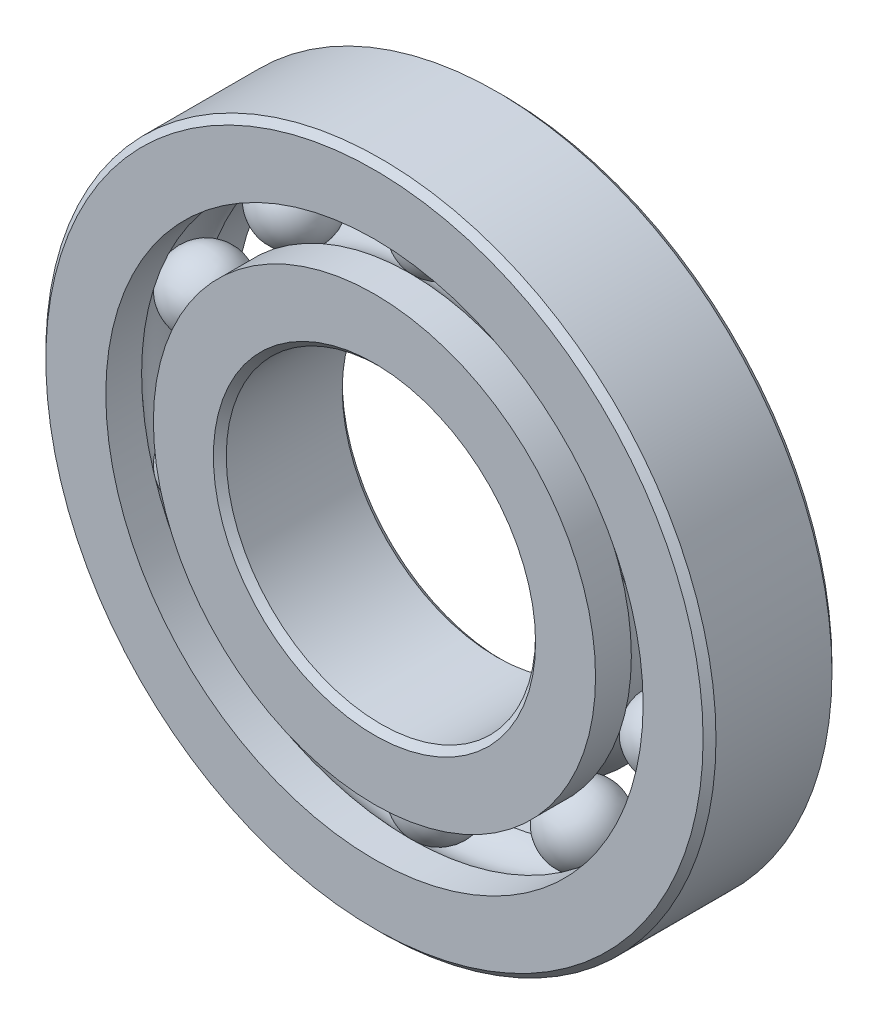
ISO-10303-21;
HEADER;
FILE_DESCRIPTION(('STEP AP214'),'2;1');
FILE_NAME('part.step','',(''),(''),'','','');
FILE_SCHEMA(('AUTOMOTIVE_DESIGN { 1 0 10303 214 1 1 1 1 }'));
ENDSEC;
DATA;
#1=APPLICATION_CONTEXT('core data for automotive mechanical design processes');
#2=APPLICATION_PROTOCOL_DEFINITION('international standard','automotive_design',2000,#1);
#3=PRODUCT_CONTEXT('',#1,'mechanical');
#4=PRODUCT('Part','Part','',(#3));
#5=PRODUCT_RELATED_PRODUCT_CATEGORY('part','',(#4));
#6=PRODUCT_DEFINITION_FORMATION('','',#4);
#7=PRODUCT_DEFINITION_CONTEXT('part definition',#1,'design');
#8=PRODUCT_DEFINITION('design','',#6,#7);
#9=PRODUCT_DEFINITION_SHAPE('','',#8);
#10=(LENGTH_UNIT() NAMED_UNIT(*) SI_UNIT(.MILLI.,.METRE.));
#11=(NAMED_UNIT(*) PLANE_ANGLE_UNIT() SI_UNIT($,.RADIAN.));
#12=(NAMED_UNIT(*) SI_UNIT($,.STERADIAN.) SOLID_ANGLE_UNIT());
#13=UNCERTAINTY_MEASURE_WITH_UNIT(LENGTH_MEASURE(1.E-05),#10,'distance_accuracy_value','');
#14=(GEOMETRIC_REPRESENTATION_CONTEXT(3) GLOBAL_UNCERTAINTY_ASSIGNED_CONTEXT((#13)) GLOBAL_UNIT_ASSIGNED_CONTEXT((#10,
#11,#12)) REPRESENTATION_CONTEXT('',''));
#15=CARTESIAN_POINT('',(0.,0.,0.));
#16=DIRECTION('',(0.,0.,1.));
#17=DIRECTION('',(1.,0.,0.));
#18=AXIS2_PLACEMENT_3D('',#15,#16,#17);
#19=CARTESIAN_POINT('',(-8.8645363361357,12.2009875464173,0.));
#20=DIRECTION('',(0.,0.,1.));
#21=DIRECTION('',(-0.587785252292462,0.809016994374955,0.));
#22=AXIS2_PLACEMENT_3D('',#19,#20,#21);
#23=SPHERICAL_SURFACE('',#22,2.29317598176668);
#24=CARTESIAN_POINT('',(-8.8645363361357,12.2009875464173,2.29317598176668));
#25=VERTEX_POINT('',#24);
#26=VERTEX_LOOP('',#25);
#27=FACE_BOUND('',#26,.T.);
#28=ADVANCED_FACE('F43',(#27),#23,.T.);
#29=CLOSED_SHELL('',(#28));
#30=MANIFOLD_SOLID_BREP('B2',#29);
#31=CARTESIAN_POINT('',(-14.3431210863762,4.66036254641734,0.));
#32=DIRECTION('',(0.,0.,1.));
#33=DIRECTION('',(-0.95105651629515,0.309016994374958,0.));
#34=AXIS2_PLACEMENT_3D('',#31,#32,#33);
#35=SPHERICAL_SURFACE('',#34,2.29317598176668);
#36=CARTESIAN_POINT('',(-14.3431210863762,4.66036254641734,2.29317598176668));
#37=VERTEX_POINT('',#36);
#38=VERTEX_LOOP('',#37);
#39=FACE_BOUND('',#38,.T.);
#40=ADVANCED_FACE('F63',(#39),#35,.T.);
#41=CLOSED_SHELL('',(#40));
#42=MANIFOLD_SOLID_BREP('B6',#41);
#43=CARTESIAN_POINT('',(-14.3431210863763,-4.66036254641704,0.));
#44=DIRECTION('',(0.,0.,1.));
#45=DIRECTION('',(-0.951056516295157,-0.309016994374938,0.));
#46=AXIS2_PLACEMENT_3D('',#43,#44,#45);
#47=SPHERICAL_SURFACE('',#46,2.29317598176668);
#48=CARTESIAN_POINT('',(-14.3431210863763,-4.66036254641704,2.29317598176668));
#49=VERTEX_POINT('',#48);
#50=VERTEX_LOOP('',#49);
#51=FACE_BOUND('',#50,.T.);
#52=ADVANCED_FACE('F83',(#51),#47,.T.);
#53=CLOSED_SHELL('',(#52));
#54=MANIFOLD_SOLID_BREP('B39',#53);
#55=CARTESIAN_POINT('',(-8.86453633613597,-12.2009875464171,0.));
#56=DIRECTION('',(0.,0.,1.));
#57=DIRECTION('',(-0.58778525229248,-0.809016994374942,0.));
#58=AXIS2_PLACEMENT_3D('',#55,#56,#57);
#59=SPHERICAL_SURFACE('',#58,2.29317598176668);
#60=CARTESIAN_POINT('',(-8.86453633613597,-12.2009875464171,2.29317598176668));
#61=VERTEX_POINT('',#60);
#62=VERTEX_LOOP('',#61);
#63=FACE_BOUND('',#62,.T.);
#64=ADVANCED_FACE('F103',(#63),#59,.T.);
#65=CLOSED_SHELL('',(#64));
#66=MANIFOLD_SOLID_BREP('B59',#65);
#67=CARTESIAN_POINT('',(-1.05311866879462E-13,-15.08125,0.));
#68=DIRECTION('',(0.,0.,1.));
#69=DIRECTION('',(0.,-1.,0.));
#70=AXIS2_PLACEMENT_3D('',#67,#68,#69);
#71=SPHERICAL_SURFACE('',#70,2.29317598176668);
#72=CARTESIAN_POINT('',(-1.05311866879462E-13,-15.08125,2.29317598176668));
#73=VERTEX_POINT('',#72);
#74=VERTEX_LOOP('',#73);
#75=FACE_BOUND('',#74,.T.);
#76=ADVANCED_FACE('F123',(#75),#71,.T.);
#77=CLOSED_SHELL('',(#76));
#78=MANIFOLD_SOLID_BREP('B79',#77);
#79=CARTESIAN_POINT('',(8.86453633613579,-12.2009875464172,0.));
#80=DIRECTION('',(0.,0.,1.));
#81=DIRECTION('',(0.587785252292469,-0.809016994374951,0.));
#82=AXIS2_PLACEMENT_3D('',#79,#80,#81);
#83=SPHERICAL_SURFACE('',#82,2.29317598176668);
#84=CARTESIAN_POINT('',(8.86453633613579,-12.2009875464172,2.29317598176668));
#85=VERTEX_POINT('',#84);
#86=VERTEX_LOOP('',#85);
#87=FACE_BOUND('',#86,.T.);
#88=ADVANCED_FACE('F143',(#87),#83,.T.);
#89=CLOSED_SHELL('',(#88));
#90=MANIFOLD_SOLID_BREP('B99',#89);
#91=CARTESIAN_POINT('',(14.3431210863763,-4.66036254641724,0.));
#92=DIRECTION('',(0.,0.,1.));
#93=DIRECTION('',(0.951056516295152,-0.309016994374952,0.));
#94=AXIS2_PLACEMENT_3D('',#91,#92,#93);
#95=SPHERICAL_SURFACE('',#94,2.29317598176668);
#96=CARTESIAN_POINT('',(14.3431210863763,-4.66036254641724,2.29317598176668));
#97=VERTEX_POINT('',#96);
#98=VERTEX_LOOP('',#97);
#99=FACE_BOUND('',#98,.T.);
#100=ADVANCED_FACE('F163',(#99),#95,.T.);
#101=CLOSED_SHELL('',(#100));
#102=MANIFOLD_SOLID_BREP('B119',#101);
#103=CARTESIAN_POINT('',(14.3431210863763,4.66036254641714,0.));
#104=DIRECTION('',(0.,0.,1.));
#105=DIRECTION('',(0.951056516295155,0.309016994374945,0.));
#106=AXIS2_PLACEMENT_3D('',#103,#104,#105);
#107=SPHERICAL_SURFACE('',#106,2.29317598176668);
#108=CARTESIAN_POINT('',(14.3431210863763,4.66036254641714,2.29317598176668));
#109=VERTEX_POINT('',#108);
#110=VERTEX_LOOP('',#109);
#111=FACE_BOUND('',#110,.T.);
#112=ADVANCED_FACE('F183',(#111),#107,.T.);
#113=CLOSED_SHELL('',(#112));
#114=MANIFOLD_SOLID_BREP('B139',#113);
#115=CARTESIAN_POINT('',(8.86453633613588,12.2009875464172,0.));
#116=DIRECTION('',(0.,0.,1.));
#117=DIRECTION('',(0.587785252292474,0.809016994374947,0.));
#118=AXIS2_PLACEMENT_3D('',#115,#116,#117);
#119=SPHERICAL_SURFACE('',#118,2.29317598176668);
#120=CARTESIAN_POINT('',(8.86453633613588,12.2009875464172,2.29317598176668));
#121=VERTEX_POINT('',#120);
#122=VERTEX_LOOP('',#121);
#123=FACE_BOUND('',#122,.T.);
#124=ADVANCED_FACE('F203',(#123),#119,.T.);
#125=CLOSED_SHELL('',(#124));
#126=MANIFOLD_SOLID_BREP('B159',#125);
#127=CARTESIAN_POINT('',(0.,15.08125,0.));
#128=DIRECTION('',(0.,0.,1.));
#129=DIRECTION('',(0.,1.,0.));
#130=AXIS2_PLACEMENT_3D('',#127,#128,#129);
#131=SPHERICAL_SURFACE('',#130,2.29317598176668);
#132=CARTESIAN_POINT('',(0.,15.08125,2.29317598176668));
#133=VERTEX_POINT('',#132);
#134=VERTEX_LOOP('',#133);
#135=FACE_BOUND('',#134,.T.);
#136=ADVANCED_FACE('F225',(#135),#131,.T.);
#137=CLOSED_SHELL('',(#136));
#138=MANIFOLD_SOLID_BREP('B179',#137);
#139=CARTESIAN_POINT('',(0.,13.6158653846154,3.96875));
#140=DIRECTION('',(0.,0.,-1.));
#141=DIRECTION('',(-1.,0.,0.));
#142=AXIS2_PLACEMENT_3D('',#139,#140,#141);
#143=PLANE('',#142);
#144=CARTESIAN_POINT('',(0.,0.,3.96875));
#145=DIRECTION('',(0.,0.,1.));
#146=DIRECTION('',(1.,0.,0.));
#147=AXIS2_PLACEMENT_3D('',#144,#145,#146);
#148=CIRCLE('',#147,9.921875);
#149=CARTESIAN_POINT('',(9.921875,0.,3.96875));
#150=VERTEX_POINT('',#149);
#151=EDGE_CURVE('E272',#150,#150,#148,.T.);
#152=ORIENTED_EDGE('',*,*,#151,.F.);
#153=EDGE_LOOP('',(#152));
#154=FACE_BOUND('',#153,.T.);
#155=CARTESIAN_POINT('',(0.,0.,3.96875));
#156=DIRECTION('',(0.,0.,1.));
#157=DIRECTION('',(1.,0.,0.));
#158=AXIS2_PLACEMENT_3D('',#155,#156,#157);
#159=CIRCLE('',#158,13.6158653846154);
#160=CARTESIAN_POINT('',(13.6158653846154,0.,3.96875));
#161=VERTEX_POINT('',#160);
#162=EDGE_CURVE('E224',#161,#161,#159,.T.);
#163=ORIENTED_EDGE('',*,*,#162,.T.);
#164=EDGE_LOOP('',(#163));
#165=FACE_BOUND('',#164,.T.);
#166=ADVANCED_FACE('F244',(#154,#165),#143,.F.);
#167=CARTESIAN_POINT('',(0.,0.,3.96875));
#168=DIRECTION('',(0.,0.,1.));
#169=DIRECTION('',(1.,0.,0.));
#170=AXIS2_PLACEMENT_3D('',#167,#168,#169);
#171=CYLINDRICAL_SURFACE('',#170,13.6158653846154);
#172=ORIENTED_EDGE('',*,*,#162,.F.);
#173=EDGE_LOOP('',(#172));
#174=FACE_BOUND('',#173,.T.);
#175=CARTESIAN_POINT('',(0.,0.,1.76388888888889));
#176=DIRECTION('',(0.,0.,1.));
#177=DIRECTION('',(1.,0.,0.));
#178=AXIS2_PLACEMENT_3D('',#175,#176,#177);
#179=CIRCLE('',#178,13.6158653846154);
#180=CARTESIAN_POINT('',(13.6158653846154,0.,1.76388888888889));
#181=VERTEX_POINT('',#180);
#182=EDGE_CURVE('E250',#181,#181,#179,.T.);
#183=ORIENTED_EDGE('',*,*,#182,.T.);
#184=EDGE_LOOP('',(#183));
#185=FACE_BOUND('',#184,.T.);
#186=ADVANCED_FACE('F279',(#174,#185),#171,.T.);
#187=CARTESIAN_POINT('',(0.,0.,0.));
#188=DIRECTION('',(0.,0.,1.));
#189=DIRECTION('',(1.,0.,0.));
#190=AXIS2_PLACEMENT_3D('',#187,#188,#189);
#191=TOROIDAL_SURFACE('',#190,15.08125,2.29317598176668);
#192=ORIENTED_EDGE('',*,*,#182,.F.);
#193=EDGE_LOOP('',(#192));
#194=FACE_BOUND('',#193,.T.);
#195=CARTESIAN_POINT('',(0.,0.,-1.76388888888889));
#196=DIRECTION('',(0.,0.,1.));
#197=DIRECTION('',(1.,0.,0.));
#198=AXIS2_PLACEMENT_3D('',#195,#196,#197);
#199=CIRCLE('',#198,13.6158653846154);
#200=CARTESIAN_POINT('',(13.6158653846154,0.,-1.76388888888889));
#201=VERTEX_POINT('',#200);
#202=EDGE_CURVE('E254',#201,#201,#199,.T.);
#203=ORIENTED_EDGE('',*,*,#202,.T.);
#204=EDGE_LOOP('',(#203));
#205=FACE_BOUND('',#204,.T.);
#206=ADVANCED_FACE('F283',(#194,#205),#191,.F.);
#207=CARTESIAN_POINT('',(0.,0.,3.96875));
#208=DIRECTION('',(0.,0.,1.));
#209=DIRECTION('',(1.,0.,0.));
#210=AXIS2_PLACEMENT_3D('',#207,#208,#209);
#211=CYLINDRICAL_SURFACE('',#210,13.6158653846154);
#212=ORIENTED_EDGE('',*,*,#202,.F.);
#213=EDGE_LOOP('',(#212));
#214=FACE_BOUND('',#213,.T.);
#215=CARTESIAN_POINT('',(0.,0.,-3.96875));
#216=DIRECTION('',(0.,0.,1.));
#217=DIRECTION('',(1.,0.,0.));
#218=AXIS2_PLACEMENT_3D('',#215,#216,#217);
#219=CIRCLE('',#218,13.6158653846154);
#220=CARTESIAN_POINT('',(13.6158653846154,0.,-3.96875));
#221=VERTEX_POINT('',#220);
#222=EDGE_CURVE('E258',#221,#221,#219,.T.);
#223=ORIENTED_EDGE('',*,*,#222,.T.);
#224=EDGE_LOOP('',(#223));
#225=FACE_BOUND('',#224,.T.);
#226=ADVANCED_FACE('F288',(#214,#225),#211,.T.);
#227=CARTESIAN_POINT('',(0.,9.921875,-3.96875));
#228=DIRECTION('',(0.,0.,1.));
#229=DIRECTION('',(1.,0.,0.));
#230=AXIS2_PLACEMENT_3D('',#227,#228,#229);
#231=PLANE('',#230);
#232=ORIENTED_EDGE('',*,*,#222,.F.);
#233=EDGE_LOOP('',(#232));
#234=FACE_BOUND('',#233,.T.);
#235=CARTESIAN_POINT('',(0.,0.,-3.96875));
#236=DIRECTION('',(0.,0.,1.));
#237=DIRECTION('',(1.,0.,0.));
#238=AXIS2_PLACEMENT_3D('',#235,#236,#237);
#239=CIRCLE('',#238,9.921875);
#240=CARTESIAN_POINT('',(9.921875,0.,-3.96875));
#241=VERTEX_POINT('',#240);
#242=EDGE_CURVE('E263',#241,#241,#239,.T.);
#243=ORIENTED_EDGE('',*,*,#242,.T.);
#244=EDGE_LOOP('',(#243));
#245=FACE_BOUND('',#244,.T.);
#246=ADVANCED_FACE('F294',(#234,#245),#231,.F.);
#247=CARTESIAN_POINT('',(0.,0.,-3.571875));
#248=DIRECTION('',(0.,0.,-1.));
#249=DIRECTION('',(-1.,0.,0.));
#250=AXIS2_PLACEMENT_3D('',#247,#248,#249);
#251=CONICAL_SURFACE('',#250,9.525,0.785398163397446);
#252=ORIENTED_EDGE('',*,*,#242,.F.);
#253=EDGE_LOOP('',(#252));
#254=FACE_BOUND('',#253,.T.);
#255=CARTESIAN_POINT('',(0.,0.,-3.571875));
#256=DIRECTION('',(0.,0.,1.));
#257=DIRECTION('',(1.,0.,0.));
#258=AXIS2_PLACEMENT_3D('',#255,#256,#257);
#259=CIRCLE('',#258,9.525);
#260=CARTESIAN_POINT('',(9.525,0.,-3.571875));
#261=VERTEX_POINT('',#260);
#262=EDGE_CURVE('E266',#261,#261,#259,.T.);
#263=ORIENTED_EDGE('',*,*,#262,.T.);
#264=EDGE_LOOP('',(#263));
#265=FACE_BOUND('',#264,.T.);
#266=ADVANCED_FACE('F298',(#254,#265),#251,.F.);
#267=CARTESIAN_POINT('',(0.,0.,3.96875));
#268=DIRECTION('',(0.,0.,1.));
#269=DIRECTION('',(1.,0.,0.));
#270=AXIS2_PLACEMENT_3D('',#267,#268,#269);
#271=CYLINDRICAL_SURFACE('',#270,9.525);
#272=ORIENTED_EDGE('',*,*,#262,.F.);
#273=EDGE_LOOP('',(#272));
#274=FACE_BOUND('',#273,.T.);
#275=CARTESIAN_POINT('',(0.,0.,3.571875));
#276=DIRECTION('',(0.,0.,1.));
#277=DIRECTION('',(1.,0.,0.));
#278=AXIS2_PLACEMENT_3D('',#275,#276,#277);
#279=CIRCLE('',#278,9.525);
#280=CARTESIAN_POINT('',(9.525,0.,3.571875));
#281=VERTEX_POINT('',#280);
#282=EDGE_CURVE('E269',#281,#281,#279,.T.);
#283=ORIENTED_EDGE('',*,*,#282,.T.);
#284=EDGE_LOOP('',(#283));
#285=FACE_BOUND('',#284,.T.);
#286=ADVANCED_FACE('F302',(#274,#285),#271,.F.);
#287=CARTESIAN_POINT('',(0.,0.,3.96875));
#288=DIRECTION('',(0.,0.,1.));
#289=DIRECTION('',(1.,0.,0.));
#290=AXIS2_PLACEMENT_3D('',#287,#288,#289);
#291=CONICAL_SURFACE('',#290,9.921875,0.78539816339745);
#292=ORIENTED_EDGE('',*,*,#282,.F.);
#293=EDGE_LOOP('',(#292));
#294=FACE_BOUND('',#293,.T.);
#295=ORIENTED_EDGE('',*,*,#151,.T.);
#296=EDGE_LOOP('',(#295));
#297=FACE_BOUND('',#296,.T.);
#298=ADVANCED_FACE('F276',(#294,#297),#291,.F.);
#299=CLOSED_SHELL('',(#166,#186,#206,#226,#246,#266,#286,#298));
#300=MANIFOLD_SOLID_BREP('B199',#299);
#301=CARTESIAN_POINT('',(0.,0.,3.571875));
#302=DIRECTION('',(0.,0.,-1.));
#303=DIRECTION('',(-1.,0.,0.));
#304=AXIS2_PLACEMENT_3D('',#301,#302,#303);
#305=CONICAL_SURFACE('',#304,20.6375,0.785398163397448);
#306=CARTESIAN_POINT('',(0.,0.,3.96875));
#307=DIRECTION('',(0.,0.,1.));
#308=DIRECTION('',(1.,0.,0.));
#309=AXIS2_PLACEMENT_3D('',#306,#307,#308);
#310=CIRCLE('',#309,20.240625);
#311=CARTESIAN_POINT('',(20.240625,0.,3.96875));
#312=VERTEX_POINT('',#311);
#313=EDGE_CURVE('E393',#312,#312,#310,.T.);
#314=ORIENTED_EDGE('',*,*,#313,.F.);
#315=EDGE_LOOP('',(#314));
#316=FACE_BOUND('',#315,.T.);
#317=CARTESIAN_POINT('',(0.,0.,3.571875));
#318=DIRECTION('',(0.,0.,1.));
#319=DIRECTION('',(1.,0.,0.));
#320=AXIS2_PLACEMENT_3D('',#317,#318,#319);
#321=CIRCLE('',#320,20.6375);
#322=CARTESIAN_POINT('',(20.6375,0.,3.571875));
#323=VERTEX_POINT('',#322);
#324=EDGE_CURVE('E243',#323,#323,#321,.T.);
#325=ORIENTED_EDGE('',*,*,#324,.T.);
#326=EDGE_LOOP('',(#325));
#327=FACE_BOUND('',#326,.T.);
#328=ADVANCED_FACE('F365',(#316,#327),#305,.T.);
#329=CARTESIAN_POINT('',(0.,0.,3.96875));
#330=DIRECTION('',(0.,0.,1.));
#331=DIRECTION('',(1.,0.,0.));
#332=AXIS2_PLACEMENT_3D('',#329,#330,#331);
#333=CYLINDRICAL_SURFACE('',#332,20.6375);
#334=ORIENTED_EDGE('',*,*,#324,.F.);
#335=EDGE_LOOP('',(#334));
#336=FACE_BOUND('',#335,.T.);
#337=CARTESIAN_POINT('',(0.,0.,-3.571875));
#338=DIRECTION('',(0.,0.,1.));
#339=DIRECTION('',(1.,0.,0.));
#340=AXIS2_PLACEMENT_3D('',#337,#338,#339);
#341=CIRCLE('',#340,20.6375);
#342=CARTESIAN_POINT('',(20.6375,0.,-3.571875));
#343=VERTEX_POINT('',#342);
#344=EDGE_CURVE('E371',#343,#343,#341,.T.);
#345=ORIENTED_EDGE('',*,*,#344,.T.);
#346=EDGE_LOOP('',(#345));
#347=FACE_BOUND('',#346,.T.);
#348=ADVANCED_FACE('F400',(#336,#347),#333,.T.);
#349=CARTESIAN_POINT('',(0.,0.,-3.96875));
#350=DIRECTION('',(0.,0.,1.));
#351=DIRECTION('',(1.,0.,0.));
#352=AXIS2_PLACEMENT_3D('',#349,#350,#351);
#353=CONICAL_SURFACE('',#352,20.240625,0.785398163397446);
#354=ORIENTED_EDGE('',*,*,#344,.F.);
#355=EDGE_LOOP('',(#354));
#356=FACE_BOUND('',#355,.T.);
#357=CARTESIAN_POINT('',(0.,0.,-3.96875));
#358=DIRECTION('',(0.,0.,1.));
#359=DIRECTION('',(1.,0.,0.));
#360=AXIS2_PLACEMENT_3D('',#357,#358,#359);
#361=CIRCLE('',#360,20.240625);
#362=CARTESIAN_POINT('',(20.240625,0.,-3.96875));
#363=VERTEX_POINT('',#362);
#364=EDGE_CURVE('E375',#363,#363,#361,.T.);
#365=ORIENTED_EDGE('',*,*,#364,.T.);
#366=EDGE_LOOP('',(#365));
#367=FACE_BOUND('',#366,.T.);
#368=ADVANCED_FACE('F404',(#356,#367),#353,.T.);
#369=CARTESIAN_POINT('',(0.,20.240625,-3.96875));
#370=DIRECTION('',(0.,0.,1.));
#371=DIRECTION('',(1.,0.,0.));
#372=AXIS2_PLACEMENT_3D('',#369,#370,#371);
#373=PLANE('',#372);
#374=ORIENTED_EDGE('',*,*,#364,.F.);
#375=EDGE_LOOP('',(#374));
#376=FACE_BOUND('',#375,.T.);
#377=CARTESIAN_POINT('',(0.,0.,-3.96875));
#378=DIRECTION('',(0.,0.,1.));
#379=DIRECTION('',(1.,0.,0.));
#380=AXIS2_PLACEMENT_3D('',#377,#378,#379);
#381=CIRCLE('',#380,16.5466346153846);
#382=CARTESIAN_POINT('',(16.5466346153846,0.,-3.96875));
#383=VERTEX_POINT('',#382);
#384=EDGE_CURVE('E379',#383,#383,#381,.T.);
#385=ORIENTED_EDGE('',*,*,#384,.T.);
#386=EDGE_LOOP('',(#385));
#387=FACE_BOUND('',#386,.T.);
#388=ADVANCED_FACE('F409',(#376,#387),#373,.F.);
#389=CARTESIAN_POINT('',(0.,0.,3.96875));
#390=DIRECTION('',(0.,0.,1.));
#391=DIRECTION('',(1.,0.,0.));
#392=AXIS2_PLACEMENT_3D('',#389,#390,#391);
#393=CYLINDRICAL_SURFACE('',#392,16.5466346153846);
#394=ORIENTED_EDGE('',*,*,#384,.F.);
#395=EDGE_LOOP('',(#394));
#396=FACE_BOUND('',#395,.T.);
#397=CARTESIAN_POINT('',(0.,0.,-1.76388888888889));
#398=DIRECTION('',(0.,0.,1.));
#399=DIRECTION('',(1.,0.,0.));
#400=AXIS2_PLACEMENT_3D('',#397,#398,#399);
#401=CIRCLE('',#400,16.5466346153846);
#402=CARTESIAN_POINT('',(16.5466346153846,0.,-1.76388888888889));
#403=VERTEX_POINT('',#402);
#404=EDGE_CURVE('E384',#403,#403,#401,.T.);
#405=ORIENTED_EDGE('',*,*,#404,.T.);
#406=EDGE_LOOP('',(#405));
#407=FACE_BOUND('',#406,.T.);
#408=ADVANCED_FACE('F415',(#396,#407),#393,.F.);
#409=CARTESIAN_POINT('',(0.,0.,0.));
#410=DIRECTION('',(0.,0.,1.));
#411=DIRECTION('',(1.,0.,0.));
#412=AXIS2_PLACEMENT_3D('',#409,#410,#411);
#413=TOROIDAL_SURFACE('',#412,15.08125,2.29317598176668);
#414=ORIENTED_EDGE('',*,*,#404,.F.);
#415=EDGE_LOOP('',(#414));
#416=FACE_BOUND('',#415,.T.);
#417=CARTESIAN_POINT('',(0.,0.,1.76388888888889));
#418=DIRECTION('',(0.,0.,1.));
#419=DIRECTION('',(1.,0.,0.));
#420=AXIS2_PLACEMENT_3D('',#417,#418,#419);
#421=CIRCLE('',#420,16.5466346153846);
#422=CARTESIAN_POINT('',(16.5466346153846,0.,1.76388888888889));
#423=VERTEX_POINT('',#422);
#424=EDGE_CURVE('E387',#423,#423,#421,.T.);
#425=ORIENTED_EDGE('',*,*,#424,.T.);
#426=EDGE_LOOP('',(#425));
#427=FACE_BOUND('',#426,.T.);
#428=ADVANCED_FACE('F419',(#416,#427),#413,.F.);
#429=CARTESIAN_POINT('',(0.,0.,3.96875));
#430=DIRECTION('',(0.,0.,1.));
#431=DIRECTION('',(1.,0.,0.));
#432=AXIS2_PLACEMENT_3D('',#429,#430,#431);
#433=CYLINDRICAL_SURFACE('',#432,16.5466346153846);
#434=ORIENTED_EDGE('',*,*,#424,.F.);
#435=EDGE_LOOP('',(#434));
#436=FACE_BOUND('',#435,.T.);
#437=CARTESIAN_POINT('',(0.,0.,3.96875));
#438=DIRECTION('',(0.,0.,1.));
#439=DIRECTION('',(1.,0.,0.));
#440=AXIS2_PLACEMENT_3D('',#437,#438,#439);
#441=CIRCLE('',#440,16.5466346153846);
#442=CARTESIAN_POINT('',(16.5466346153846,0.,3.96875));
#443=VERTEX_POINT('',#442);
#444=EDGE_CURVE('E390',#443,#443,#441,.T.);
#445=ORIENTED_EDGE('',*,*,#444,.T.);
#446=EDGE_LOOP('',(#445));
#447=FACE_BOUND('',#446,.T.);
#448=ADVANCED_FACE('F423',(#436,#447),#433,.F.);
#449=CARTESIAN_POINT('',(0.,20.240625,3.96875));
#450=DIRECTION('',(0.,0.,-1.));
#451=DIRECTION('',(-1.,0.,0.));
#452=AXIS2_PLACEMENT_3D('',#449,#450,#451);
#453=PLANE('',#452);
#454=ORIENTED_EDGE('',*,*,#444,.F.);
#455=EDGE_LOOP('',(#454));
#456=FACE_BOUND('',#455,.T.);
#457=ORIENTED_EDGE('',*,*,#313,.T.);
#458=EDGE_LOOP('',(#457));
#459=FACE_BOUND('',#458,.T.);
#460=ADVANCED_FACE('F397',(#456,#459),#453,.F.);
#461=CLOSED_SHELL('',(#328,#348,#368,#388,#408,#428,#448,#460));
#462=MANIFOLD_SOLID_BREP('B219',#461);
#463=ADVANCED_BREP_SHAPE_REPRESENTATION('',(#18,#30,#42,#54,#66,#78,#90,#102,#114,#126,#138,
#300,#462),#14);
#464=SHAPE_DEFINITION_REPRESENTATION(#9,#463);
ENDSEC;
END-ISO-10303-21;
